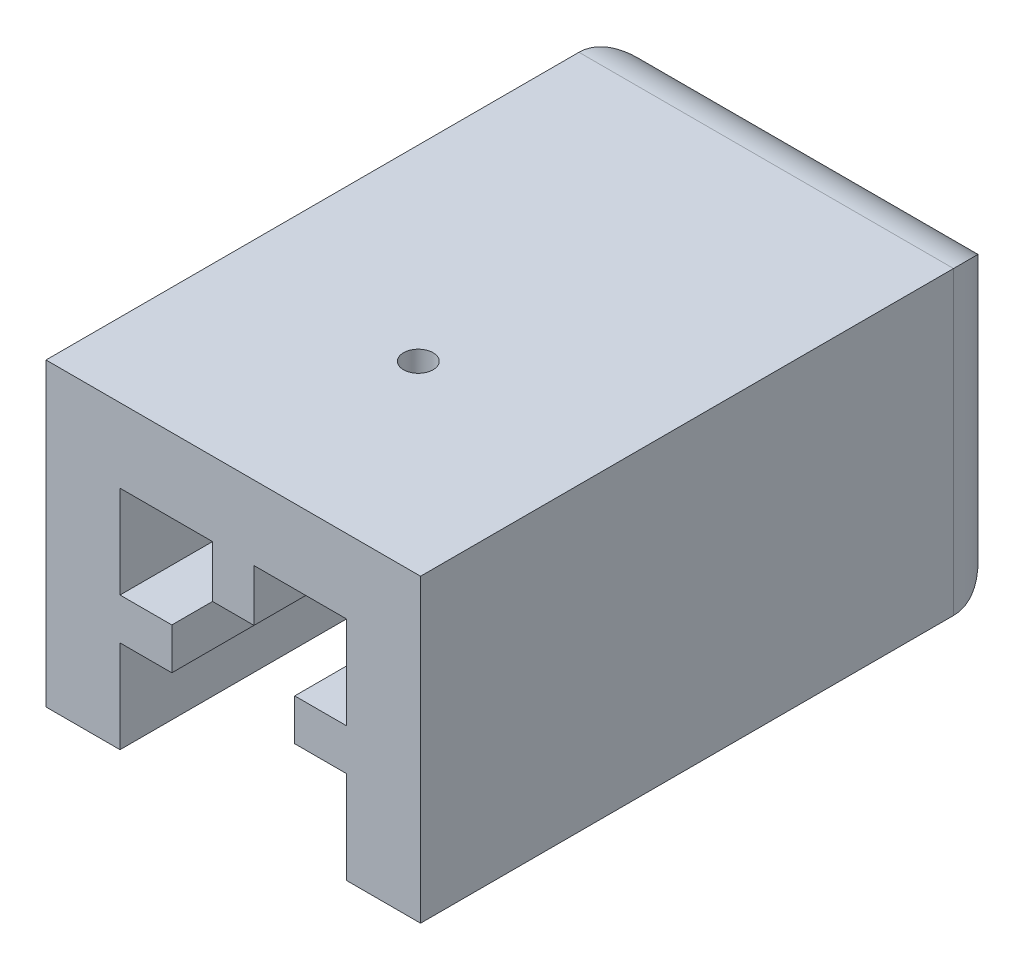
ISO-10303-21;
HEADER;
FILE_DESCRIPTION(('STEP AP214'),'2;1');
FILE_NAME('part.step','',(''),(''),'','','');
FILE_SCHEMA(('AUTOMOTIVE_DESIGN { 1 0 10303 214 1 1 1 1 }'));
ENDSEC;
DATA;
#1=APPLICATION_CONTEXT('core data for automotive mechanical design processes');
#2=APPLICATION_PROTOCOL_DEFINITION('international standard','automotive_design',2000,#1);
#3=PRODUCT_CONTEXT('',#1,'mechanical');
#4=PRODUCT('Part','Part','',(#3));
#5=PRODUCT_RELATED_PRODUCT_CATEGORY('part','',(#4));
#6=PRODUCT_DEFINITION_FORMATION('','',#4);
#7=PRODUCT_DEFINITION_CONTEXT('part definition',#1,'design');
#8=PRODUCT_DEFINITION('design','',#6,#7);
#9=PRODUCT_DEFINITION_SHAPE('','',#8);
#10=(LENGTH_UNIT() NAMED_UNIT(*) SI_UNIT(.MILLI.,.METRE.));
#11=(NAMED_UNIT(*) PLANE_ANGLE_UNIT() SI_UNIT($,.RADIAN.));
#12=(NAMED_UNIT(*) SI_UNIT($,.STERADIAN.) SOLID_ANGLE_UNIT());
#13=UNCERTAINTY_MEASURE_WITH_UNIT(LENGTH_MEASURE(1.E-05),#10,'distance_accuracy_value','');
#14=(GEOMETRIC_REPRESENTATION_CONTEXT(3) GLOBAL_UNCERTAINTY_ASSIGNED_CONTEXT((#13)) GLOBAL_UNIT_ASSIGNED_CONTEXT((#10,
#11,#12)) REPRESENTATION_CONTEXT('',''));
#15=CARTESIAN_POINT('',(0.,0.,0.));
#16=DIRECTION('',(0.,0.,1.));
#17=DIRECTION('',(1.,0.,0.));
#18=AXIS2_PLACEMENT_3D('',#15,#16,#17);
#19=CARTESIAN_POINT('',(-7.65,15.3,20.));
#20=DIRECTION('',(-1.,0.,0.));
#21=DIRECTION('',(0.,-1.,0.));
#22=AXIS2_PLACEMENT_3D('',#19,#20,#21);
#23=PLANE('',#22);
#24=DIRECTION('',(0.,1.,0.));
#25=VECTOR('',#24,1.);
#26=CARTESIAN_POINT('',(-7.65,9.05,3.));
#27=LINE('',#26,#25);
#28=CARTESIAN_POINT('',(-7.65,6.25,3.));
#29=VERTEX_POINT('',#28);
#30=CARTESIAN_POINT('',(-7.65,9.05,3.));
#31=VERTEX_POINT('',#30);
#32=EDGE_CURVE('E442',#29,#31,#27,.T.);
#33=ORIENTED_EDGE('',*,*,#32,.F.);
#34=DIRECTION('',(0.,0.,1.));
#35=VECTOR('',#34,1.);
#36=CARTESIAN_POINT('',(-7.65,6.25,-4.48218696620299));
#37=LINE('',#36,#35);
#38=CARTESIAN_POINT('',(-7.65,6.25,20.));
#39=VERTEX_POINT('',#38);
#40=EDGE_CURVE('E459',#29,#39,#37,.T.);
#41=ORIENTED_EDGE('',*,*,#40,.T.);
#42=DIRECTION('',(0.,1.,0.));
#43=VECTOR('',#42,1.);
#44=CARTESIAN_POINT('',(-7.65,15.3,20.));
#45=LINE('',#44,#43);
#46=CARTESIAN_POINT('',(-7.65,0.,20.));
#47=VERTEX_POINT('',#46);
#48=EDGE_CURVE('E267',#47,#39,#45,.T.);
#49=ORIENTED_EDGE('',*,*,#48,.F.);
#50=DIRECTION('',(0.,0.,-1.));
#51=VECTOR('',#50,1.);
#52=CARTESIAN_POINT('',(-7.65,0.,20.));
#53=LINE('',#52,#51);
#54=CARTESIAN_POINT('',(-7.65,0.,0.));
#55=VERTEX_POINT('',#54);
#56=EDGE_CURVE('E282',#47,#55,#53,.T.);
#57=ORIENTED_EDGE('',*,*,#56,.T.);
#58=DIRECTION('',(0.,1.,0.));
#59=VECTOR('',#58,1.);
#60=CARTESIAN_POINT('',(-7.65,15.3,0.));
#61=LINE('',#60,#59);
#62=CARTESIAN_POINT('',(-7.65,15.3,0.));
#63=VERTEX_POINT('',#62);
#64=EDGE_CURVE('E283',#55,#63,#61,.T.);
#65=ORIENTED_EDGE('',*,*,#64,.T.);
#66=DIRECTION('',(0.,0.,-1.));
#67=VECTOR('',#66,1.);
#68=CARTESIAN_POINT('',(-7.65,15.3,20.));
#69=LINE('',#68,#67);
#70=CARTESIAN_POINT('',(-7.65,15.3,20.));
#71=VERTEX_POINT('',#70);
#72=EDGE_CURVE('E310',#71,#63,#69,.T.);
#73=ORIENTED_EDGE('',*,*,#72,.F.);
#74=CARTESIAN_POINT('',(-7.65,9.05,20.));
#75=VERTEX_POINT('',#74);
#76=EDGE_CURVE('E261',#75,#71,#45,.T.);
#77=ORIENTED_EDGE('',*,*,#76,.F.);
#78=DIRECTION('',(0.,0.,1.));
#79=VECTOR('',#78,1.);
#80=CARTESIAN_POINT('',(-7.65,9.05,-4.48218696620299));
#81=LINE('',#80,#79);
#82=EDGE_CURVE('E462',#31,#75,#81,.T.);
#83=ORIENTED_EDGE('',*,*,#82,.F.);
#84=EDGE_LOOP('',(#33,#41,#49,#57,#65,#73,#77,#83));
#85=FACE_BOUND('',#84,.T.);
#86=ADVANCED_FACE('F51',(#85),#23,.F.);
#87=CARTESIAN_POINT('',(7.65,15.3,20.));
#88=DIRECTION('',(0.,1.,0.));
#89=DIRECTION('',(0.,0.,1.));
#90=AXIS2_PLACEMENT_3D('',#87,#88,#89);
#91=PLANE('',#90);
#92=DIRECTION('',(1.,0.,0.));
#93=VECTOR('',#92,1.);
#94=CARTESIAN_POINT('',(7.65,15.3,20.));
#95=LINE('',#94,#93);
#96=CARTESIAN_POINT('',(1.4,15.3,20.));
#97=VERTEX_POINT('',#96);
#98=CARTESIAN_POINT('',(7.65,15.3,20.));
#99=VERTEX_POINT('',#98);
#100=EDGE_CURVE('E263',#97,#99,#95,.T.);
#101=ORIENTED_EDGE('',*,*,#100,.F.);
#102=DIRECTION('',(0.,0.,1.));
#103=VECTOR('',#102,1.);
#104=CARTESIAN_POINT('',(1.4,15.3,-4.48218696620299));
#105=LINE('',#104,#103);
#106=CARTESIAN_POINT('',(1.4,15.3,3.));
#107=VERTEX_POINT('',#106);
#108=EDGE_CURVE('E429',#107,#97,#105,.T.);
#109=ORIENTED_EDGE('',*,*,#108,.F.);
#110=DIRECTION('',(1.,0.,0.));
#111=VECTOR('',#110,1.);
#112=CARTESIAN_POINT('',(-1.4,15.3,3.));
#113=LINE('',#112,#111);
#114=CARTESIAN_POINT('',(-1.4,15.3,3.));
#115=VERTEX_POINT('',#114);
#116=EDGE_CURVE('E255',#115,#107,#113,.T.);
#117=ORIENTED_EDGE('',*,*,#116,.F.);
#118=DIRECTION('',(0.,0.,1.));
#119=VECTOR('',#118,1.);
#120=CARTESIAN_POINT('',(-1.4,15.3,-4.48218696620299));
#121=LINE('',#120,#119);
#122=CARTESIAN_POINT('',(-1.4,15.3,20.));
#123=VERTEX_POINT('',#122);
#124=EDGE_CURVE('E236',#115,#123,#121,.T.);
#125=ORIENTED_EDGE('',*,*,#124,.T.);
#126=EDGE_CURVE('E252',#71,#123,#95,.T.);
#127=ORIENTED_EDGE('',*,*,#126,.F.);
#128=ORIENTED_EDGE('',*,*,#72,.T.);
#129=DIRECTION('',(1.,0.,0.));
#130=VECTOR('',#129,1.);
#131=CARTESIAN_POINT('',(7.65,15.3,0.));
#132=LINE('',#131,#130);
#133=CARTESIAN_POINT('',(7.65,15.3,0.));
#134=VERTEX_POINT('',#133);
#135=EDGE_CURVE('E286',#63,#134,#132,.T.);
#136=ORIENTED_EDGE('',*,*,#135,.T.);
#137=DIRECTION('',(0.,0.,-1.));
#138=VECTOR('',#137,1.);
#139=CARTESIAN_POINT('',(7.65,15.3,20.));
#140=LINE('',#139,#138);
#141=EDGE_CURVE('E307',#99,#134,#140,.T.);
#142=ORIENTED_EDGE('',*,*,#141,.F.);
#143=EDGE_LOOP('',(#101,#109,#117,#125,#127,#128,#136,#142));
#144=FACE_BOUND('',#143,.T.);
#145=ADVANCED_FACE('F250',(#144),#91,.F.);
#146=CARTESIAN_POINT('',(7.65,15.3,20.));
#147=DIRECTION('',(1.,0.,0.));
#148=DIRECTION('',(0.,1.,0.));
#149=AXIS2_PLACEMENT_3D('',#146,#147,#148);
#150=PLANE('',#149);
#151=DIRECTION('',(0.,-1.,0.));
#152=VECTOR('',#151,1.);
#153=CARTESIAN_POINT('',(7.65,15.3,20.));
#154=LINE('',#153,#152);
#155=CARTESIAN_POINT('',(7.65,6.25,20.));
#156=VERTEX_POINT('',#155);
#157=CARTESIAN_POINT('',(7.65,0.,20.));
#158=VERTEX_POINT('',#157);
#159=EDGE_CURVE('E262',#156,#158,#154,.T.);
#160=ORIENTED_EDGE('',*,*,#159,.F.);
#161=DIRECTION('',(0.,0.,1.));
#162=VECTOR('',#161,1.);
#163=CARTESIAN_POINT('',(7.65,6.25,-4.48218696620299));
#164=LINE('',#163,#162);
#165=CARTESIAN_POINT('',(7.65,6.25,3.));
#166=VERTEX_POINT('',#165);
#167=EDGE_CURVE('E471',#166,#156,#164,.T.);
#168=ORIENTED_EDGE('',*,*,#167,.F.);
#169=DIRECTION('',(0.,-1.,0.));
#170=VECTOR('',#169,1.);
#171=CARTESIAN_POINT('',(7.65,9.05,3.));
#172=LINE('',#171,#170);
#173=CARTESIAN_POINT('',(7.65,9.05,3.));
#174=VERTEX_POINT('',#173);
#175=EDGE_CURVE('E473',#174,#166,#172,.T.);
#176=ORIENTED_EDGE('',*,*,#175,.F.);
#177=DIRECTION('',(0.,0.,1.));
#178=VECTOR('',#177,1.);
#179=CARTESIAN_POINT('',(7.65,9.05,-4.48218696620299));
#180=LINE('',#179,#178);
#181=CARTESIAN_POINT('',(7.65,9.05,20.));
#182=VERTEX_POINT('',#181);
#183=EDGE_CURVE('E483',#174,#182,#180,.T.);
#184=ORIENTED_EDGE('',*,*,#183,.T.);
#185=EDGE_CURVE('E265',#99,#182,#154,.T.);
#186=ORIENTED_EDGE('',*,*,#185,.F.);
#187=ORIENTED_EDGE('',*,*,#141,.T.);
#188=DIRECTION('',(0.,-1.,0.));
#189=VECTOR('',#188,1.);
#190=CARTESIAN_POINT('',(7.65,15.3,0.));
#191=LINE('',#190,#189);
#192=CARTESIAN_POINT('',(7.65,0.,0.));
#193=VERTEX_POINT('',#192);
#194=EDGE_CURVE('E290',#134,#193,#191,.T.);
#195=ORIENTED_EDGE('',*,*,#194,.T.);
#196=DIRECTION('',(0.,0.,-1.));
#197=VECTOR('',#196,1.);
#198=CARTESIAN_POINT('',(7.65,0.,20.));
#199=LINE('',#198,#197);
#200=EDGE_CURVE('E304',#158,#193,#199,.T.);
#201=ORIENTED_EDGE('',*,*,#200,.F.);
#202=EDGE_LOOP('',(#160,#168,#176,#184,#186,#187,#195,#201));
#203=FACE_BOUND('',#202,.T.);
#204=ADVANCED_FACE('F364',(#203),#150,.F.);
#205=CARTESIAN_POINT('',(12.65,0.,20.));
#206=DIRECTION('',(-1.,0.,0.));
#207=DIRECTION('',(0.,0.,1.));
#208=AXIS2_PLACEMENT_3D('',#205,#206,#207);
#209=PLANE('',#208);
#210=DIRECTION('',(0.,0.,-1.));
#211=VECTOR('',#210,1.);
#212=CARTESIAN_POINT('',(12.65,0.,20.));
#213=LINE('',#212,#211);
#214=CARTESIAN_POINT('',(12.65,0.,20.));
#215=VERTEX_POINT('',#214);
#216=CARTESIAN_POINT('',(12.65,0.,-16.));
#217=VERTEX_POINT('',#216);
#218=EDGE_CURVE('E302',#215,#217,#213,.T.);
#219=ORIENTED_EDGE('',*,*,#218,.T.);
#220=DIRECTION('',(0.,-1.,0.));
#221=VECTOR('',#220,1.);
#222=CARTESIAN_POINT('',(12.65,0.,-16.));
#223=LINE('',#222,#221);
#224=CARTESIAN_POINT('',(12.65,20.3,-16.));
#225=VERTEX_POINT('',#224);
#226=EDGE_CURVE('E14',#217,#225,#223,.F.);
#227=ORIENTED_EDGE('',*,*,#226,.T.);
#228=DIRECTION('',(0.,0.,-1.));
#229=VECTOR('',#228,1.);
#230=CARTESIAN_POINT('',(12.65,20.3,20.));
#231=LINE('',#230,#229);
#232=CARTESIAN_POINT('',(12.65,20.3,20.));
#233=VERTEX_POINT('',#232);
#234=EDGE_CURVE('E300',#233,#225,#231,.T.);
#235=ORIENTED_EDGE('',*,*,#234,.F.);
#236=DIRECTION('',(0.,1.,0.));
#237=VECTOR('',#236,1.);
#238=CARTESIAN_POINT('',(12.65,0.,20.));
#239=LINE('',#238,#237);
#240=EDGE_CURVE('E274',#215,#233,#239,.T.);
#241=ORIENTED_EDGE('',*,*,#240,.F.);
#242=EDGE_LOOP('',(#219,#227,#235,#241));
#243=FACE_BOUND('',#242,.T.);
#244=ADVANCED_FACE('F370',(#243),#209,.F.);
#245=CARTESIAN_POINT('',(-12.65,20.3,20.));
#246=DIRECTION('',(0.,-1.,0.));
#247=DIRECTION('',(0.,0.,-1.));
#248=AXIS2_PLACEMENT_3D('',#245,#246,#247);
#249=PLANE('',#248);
#250=CARTESIAN_POINT('',(0.,20.3,7.5));
#251=DIRECTION('',(0.,-1.,0.));
#252=DIRECTION('',(0.,0.,-1.));
#253=AXIS2_PLACEMENT_3D('',#250,#251,#252);
#254=CIRCLE('',#253,1.);
#255=CARTESIAN_POINT('',(0.,20.3,6.5));
#256=VERTEX_POINT('',#255);
#257=EDGE_CURVE('E315',#256,#256,#254,.T.);
#258=ORIENTED_EDGE('',*,*,#257,.T.);
#259=EDGE_LOOP('',(#258));
#260=FACE_BOUND('',#259,.T.);
#261=ORIENTED_EDGE('',*,*,#234,.T.);
#262=DIRECTION('',(-1.,0.,0.));
#263=VECTOR('',#262,1.);
#264=CARTESIAN_POINT('',(-12.65,20.3,-16.));
#265=LINE('',#264,#263);
#266=CARTESIAN_POINT('',(-12.65,20.3,-16.));
#267=VERTEX_POINT('',#266);
#268=EDGE_CURVE('E329',#225,#267,#265,.T.);
#269=ORIENTED_EDGE('',*,*,#268,.T.);
#270=DIRECTION('',(0.,0.,-1.));
#271=VECTOR('',#270,1.);
#272=CARTESIAN_POINT('',(-12.65,20.3,20.));
#273=LINE('',#272,#271);
#274=CARTESIAN_POINT('',(-12.65,20.3,20.));
#275=VERTEX_POINT('',#274);
#276=EDGE_CURVE('E297',#275,#267,#273,.T.);
#277=ORIENTED_EDGE('',*,*,#276,.F.);
#278=DIRECTION('',(-1.,0.,0.));
#279=VECTOR('',#278,1.);
#280=CARTESIAN_POINT('',(-12.65,20.3,20.));
#281=LINE('',#280,#279);
#282=EDGE_CURVE('E276',#233,#275,#281,.T.);
#283=ORIENTED_EDGE('',*,*,#282,.F.);
#284=EDGE_LOOP('',(#261,#269,#277,#283));
#285=FACE_BOUND('',#284,.T.);
#286=ADVANCED_FACE('F374',(#260,#285),#249,.F.);
#287=CARTESIAN_POINT('',(-12.65,0.,20.));
#288=DIRECTION('',(1.,0.,0.));
#289=DIRECTION('',(0.,0.,-1.));
#290=AXIS2_PLACEMENT_3D('',#287,#288,#289);
#291=PLANE('',#290);
#292=ORIENTED_EDGE('',*,*,#276,.T.);
#293=DIRECTION('',(0.,-1.,0.));
#294=VECTOR('',#293,1.);
#295=CARTESIAN_POINT('',(-12.65,0.,-16.));
#296=LINE('',#295,#294);
#297=CARTESIAN_POINT('',(-12.65,0.,-16.));
#298=VERTEX_POINT('',#297);
#299=EDGE_CURVE('E312',#267,#298,#296,.T.);
#300=ORIENTED_EDGE('',*,*,#299,.T.);
#301=DIRECTION('',(0.,0.,-1.));
#302=VECTOR('',#301,1.);
#303=CARTESIAN_POINT('',(-12.65,0.,20.));
#304=LINE('',#303,#302);
#305=CARTESIAN_POINT('',(-12.65,0.,20.));
#306=VERTEX_POINT('',#305);
#307=EDGE_CURVE('E295',#306,#298,#304,.T.);
#308=ORIENTED_EDGE('',*,*,#307,.F.);
#309=DIRECTION('',(0.,-1.,0.));
#310=VECTOR('',#309,1.);
#311=CARTESIAN_POINT('',(-12.65,0.,20.));
#312=LINE('',#311,#310);
#313=EDGE_CURVE('E278',#275,#306,#312,.T.);
#314=ORIENTED_EDGE('',*,*,#313,.F.);
#315=EDGE_LOOP('',(#292,#300,#308,#314));
#316=FACE_BOUND('',#315,.T.);
#317=ADVANCED_FACE('F377',(#316),#291,.F.);
#318=CARTESIAN_POINT('',(-7.65,0.,20.));
#319=DIRECTION('',(0.,1.,0.));
#320=DIRECTION('',(-1.,0.,0.));
#321=AXIS2_PLACEMENT_3D('',#318,#319,#320);
#322=PLANE('',#321);
#323=ORIENTED_EDGE('',*,*,#307,.T.);
#324=DIRECTION('',(-1.,0.,0.));
#325=VECTOR('',#324,1.);
#326=CARTESIAN_POINT('',(-7.65,0.,-16.));
#327=LINE('',#326,#325);
#328=EDGE_CURVE('E60',#298,#217,#327,.F.);
#329=ORIENTED_EDGE('',*,*,#328,.T.);
#330=ORIENTED_EDGE('',*,*,#218,.F.);
#331=DIRECTION('',(1.,0.,0.));
#332=VECTOR('',#331,1.);
#333=CARTESIAN_POINT('',(7.65,0.,20.));
#334=LINE('',#333,#332);
#335=EDGE_CURVE('E272',#158,#215,#334,.T.);
#336=ORIENTED_EDGE('',*,*,#335,.F.);
#337=ORIENTED_EDGE('',*,*,#200,.T.);
#338=DIRECTION('',(-1.,0.,0.));
#339=VECTOR('',#338,1.);
#340=CARTESIAN_POINT('',(12.65,0.,0.));
#341=LINE('',#340,#339);
#342=CARTESIAN_POINT('',(3.85,0.,0.));
#343=VERTEX_POINT('',#342);
#344=EDGE_CURVE('E287',#193,#343,#341,.T.);
#345=ORIENTED_EDGE('',*,*,#344,.T.);
#346=DIRECTION('',(0.,0.,1.));
#347=VECTOR('',#346,1.);
#348=CARTESIAN_POINT('',(3.85,0.,-10.));
#349=LINE('',#348,#347);
#350=CARTESIAN_POINT('',(3.85,0.,-10.));
#351=VERTEX_POINT('',#350);
#352=EDGE_CURVE('E512',#351,#343,#349,.T.);
#353=ORIENTED_EDGE('',*,*,#352,.F.);
#354=DIRECTION('',(-1.,0.,0.));
#355=VECTOR('',#354,1.);
#356=CARTESIAN_POINT('',(0.,0.,-10.));
#357=LINE('',#356,#355);
#358=CARTESIAN_POINT('',(-3.85,0.,-10.));
#359=VERTEX_POINT('',#358);
#360=EDGE_CURVE('E503',#351,#359,#357,.T.);
#361=ORIENTED_EDGE('',*,*,#360,.T.);
#362=DIRECTION('',(0.,0.,1.));
#363=VECTOR('',#362,1.);
#364=CARTESIAN_POINT('',(-3.85,0.,-10.));
#365=LINE('',#364,#363);
#366=CARTESIAN_POINT('',(-3.85,0.,0.));
#367=VERTEX_POINT('',#366);
#368=EDGE_CURVE('E506',#359,#367,#365,.T.);
#369=ORIENTED_EDGE('',*,*,#368,.T.);
#370=EDGE_CURVE('E406',#367,#55,#341,.T.);
#371=ORIENTED_EDGE('',*,*,#370,.T.);
#372=ORIENTED_EDGE('',*,*,#56,.F.);
#373=DIRECTION('',(1.,0.,0.));
#374=VECTOR('',#373,1.);
#375=CARTESIAN_POINT('',(-7.65,0.,20.));
#376=LINE('',#375,#374);
#377=EDGE_CURVE('E280',#306,#47,#376,.T.);
#378=ORIENTED_EDGE('',*,*,#377,.F.);
#379=EDGE_LOOP('',(#323,#329,#330,#336,#337,#345,#353,#361,#369,#371,#372,#378));
#380=FACE_BOUND('',#379,.T.);
#381=ADVANCED_FACE('F381',(#380),#322,.F.);
#382=CARTESIAN_POINT('',(0.,0.,20.));
#383=DIRECTION('',(0.,0.,-1.));
#384=DIRECTION('',(-1.,0.,0.));
#385=AXIS2_PLACEMENT_3D('',#382,#383,#384);
#386=PLANE('',#385);
#387=ORIENTED_EDGE('',*,*,#48,.T.);
#388=DIRECTION('',(1.,0.,0.));
#389=VECTOR('',#388,1.);
#390=CARTESIAN_POINT('',(-4.15,6.25,20.));
#391=LINE('',#390,#389);
#392=CARTESIAN_POINT('',(-4.15,6.25,20.));
#393=VERTEX_POINT('',#392);
#394=EDGE_CURVE('E454',#39,#393,#391,.T.);
#395=ORIENTED_EDGE('',*,*,#394,.T.);
#396=DIRECTION('',(0.,1.,0.));
#397=VECTOR('',#396,1.);
#398=CARTESIAN_POINT('',(-4.15,9.05,20.));
#399=LINE('',#398,#397);
#400=CARTESIAN_POINT('',(-4.15,9.05,20.));
#401=VERTEX_POINT('',#400);
#402=EDGE_CURVE('E441',#393,#401,#399,.T.);
#403=ORIENTED_EDGE('',*,*,#402,.T.);
#404=DIRECTION('',(-1.,0.,0.));
#405=VECTOR('',#404,1.);
#406=CARTESIAN_POINT('',(-7.65,9.05,20.));
#407=LINE('',#406,#405);
#408=EDGE_CURVE('E452',#401,#75,#407,.T.);
#409=ORIENTED_EDGE('',*,*,#408,.T.);
#410=ORIENTED_EDGE('',*,*,#76,.T.);
#411=ORIENTED_EDGE('',*,*,#126,.T.);
#412=DIRECTION('',(0.,-1.,0.));
#413=VECTOR('',#412,1.);
#414=CARTESIAN_POINT('',(-1.4,15.3,20.));
#415=LINE('',#414,#413);
#416=CARTESIAN_POINT('',(-1.4,11.8,20.));
#417=VERTEX_POINT('',#416);
#418=EDGE_CURVE('E232',#123,#417,#415,.T.);
#419=ORIENTED_EDGE('',*,*,#418,.T.);
#420=DIRECTION('',(1.,0.,0.));
#421=VECTOR('',#420,1.);
#422=CARTESIAN_POINT('',(-1.4,11.8,20.));
#423=LINE('',#422,#421);
#424=CARTESIAN_POINT('',(1.4,11.8,20.));
#425=VERTEX_POINT('',#424);
#426=EDGE_CURVE('E244',#417,#425,#423,.T.);
#427=ORIENTED_EDGE('',*,*,#426,.T.);
#428=DIRECTION('',(0.,1.,0.));
#429=VECTOR('',#428,1.);
#430=CARTESIAN_POINT('',(1.4,11.8,20.));
#431=LINE('',#430,#429);
#432=EDGE_CURVE('E256',#425,#97,#431,.T.);
#433=ORIENTED_EDGE('',*,*,#432,.T.);
#434=ORIENTED_EDGE('',*,*,#100,.T.);
#435=ORIENTED_EDGE('',*,*,#185,.T.);
#436=DIRECTION('',(-1.,0.,0.));
#437=VECTOR('',#436,1.);
#438=CARTESIAN_POINT('',(7.65,9.05,20.));
#439=LINE('',#438,#437);
#440=CARTESIAN_POINT('',(4.15,9.05,20.));
#441=VERTEX_POINT('',#440);
#442=EDGE_CURVE('E467',#182,#441,#439,.T.);
#443=ORIENTED_EDGE('',*,*,#442,.T.);
#444=DIRECTION('',(0.,-1.,0.));
#445=VECTOR('',#444,1.);
#446=CARTESIAN_POINT('',(4.15,9.05,20.));
#447=LINE('',#446,#445);
#448=CARTESIAN_POINT('',(4.15,6.25,20.));
#449=VERTEX_POINT('',#448);
#450=EDGE_CURVE('E478',#441,#449,#447,.T.);
#451=ORIENTED_EDGE('',*,*,#450,.T.);
#452=DIRECTION('',(1.,0.,0.));
#453=VECTOR('',#452,1.);
#454=CARTESIAN_POINT('',(4.15,6.25,20.));
#455=LINE('',#454,#453);
#456=EDGE_CURVE('E481',#449,#156,#455,.T.);
#457=ORIENTED_EDGE('',*,*,#456,.T.);
#458=ORIENTED_EDGE('',*,*,#159,.T.);
#459=ORIENTED_EDGE('',*,*,#335,.T.);
#460=ORIENTED_EDGE('',*,*,#240,.T.);
#461=ORIENTED_EDGE('',*,*,#282,.T.);
#462=ORIENTED_EDGE('',*,*,#313,.T.);
#463=ORIENTED_EDGE('',*,*,#377,.T.);
#464=EDGE_LOOP('',(#387,#395,#403,#409,#410,#411,#419,#427,#433,#434,#435,#443,#451,#457,#458,
#459,#460,#461,#462,#463));
#465=FACE_BOUND('',#464,.T.);
#466=ADVANCED_FACE('F259',(#465),#386,.F.);
#467=CARTESIAN_POINT('',(0.,0.,0.));
#468=DIRECTION('',(0.,0.,1.));
#469=DIRECTION('',(1.,0.,0.));
#470=AXIS2_PLACEMENT_3D('',#467,#468,#469);
#471=PLANE('',#470);
#472=DIRECTION('',(0.,-1.,0.));
#473=VECTOR('',#472,1.);
#474=CARTESIAN_POINT('',(-3.85,0.,0.));
#475=LINE('',#474,#473);
#476=CARTESIAN_POINT('',(-3.85,7.65,0.));
#477=VERTEX_POINT('',#476);
#478=EDGE_CURVE('E493',#477,#367,#475,.T.);
#479=ORIENTED_EDGE('',*,*,#478,.F.);
#480=CARTESIAN_POINT('',(0.,7.65,0.));
#481=DIRECTION('',(0.,0.,-1.));
#482=DIRECTION('',(-1.,0.,0.));
#483=AXIS2_PLACEMENT_3D('',#480,#481,#482);
#484=CIRCLE('',#483,3.85);
#485=CARTESIAN_POINT('',(3.85,7.65,0.));
#486=VERTEX_POINT('',#485);
#487=EDGE_CURVE('E407',#477,#486,#484,.T.);
#488=ORIENTED_EDGE('',*,*,#487,.T.);
#489=DIRECTION('',(0.,-1.,0.));
#490=VECTOR('',#489,1.);
#491=CARTESIAN_POINT('',(3.85,0.,0.));
#492=LINE('',#491,#490);
#493=EDGE_CURVE('E498',#486,#343,#492,.T.);
#494=ORIENTED_EDGE('',*,*,#493,.T.);
#495=ORIENTED_EDGE('',*,*,#344,.F.);
#496=ORIENTED_EDGE('',*,*,#194,.F.);
#497=ORIENTED_EDGE('',*,*,#135,.F.);
#498=ORIENTED_EDGE('',*,*,#64,.F.);
#499=ORIENTED_EDGE('',*,*,#370,.F.);
#500=EDGE_LOOP('',(#479,#488,#494,#495,#496,#497,#498,#499));
#501=FACE_BOUND('',#500,.T.);
#502=ADVANCED_FACE('F387',(#501),#471,.T.);
#503=CARTESIAN_POINT('',(0.,0.,-20.));
#504=DIRECTION('',(0.,0.,1.));
#505=DIRECTION('',(1.,0.,0.));
#506=AXIS2_PLACEMENT_3D('',#503,#504,#505);
#507=PLANE('',#506);
#508=CARTESIAN_POINT('',(0.,7.65,-20.));
#509=DIRECTION('',(0.,0.,-1.));
#510=DIRECTION('',(-1.,0.,0.));
#511=AXIS2_PLACEMENT_3D('',#508,#509,#510);
#512=CIRCLE('',#511,3.85);
#513=CARTESIAN_POINT('',(-1.22474487139158,4.,-20.));
#514=VERTEX_POINT('',#513);
#515=CARTESIAN_POINT('',(1.22474487139159,4.,-20.));
#516=VERTEX_POINT('',#515);
#517=EDGE_CURVE('E400',#514,#516,#512,.T.);
#518=ORIENTED_EDGE('',*,*,#517,.F.);
#519=DIRECTION('',(-1.,0.,0.));
#520=VECTOR('',#519,1.);
#521=CARTESIAN_POINT('',(0.,4.,-20.));
#522=LINE('',#521,#520);
#523=CARTESIAN_POINT('',(-8.65,4.,-20.));
#524=VERTEX_POINT('',#523);
#525=EDGE_CURVE('E327',#514,#524,#522,.T.);
#526=ORIENTED_EDGE('',*,*,#525,.T.);
#527=DIRECTION('',(0.,-1.,0.));
#528=VECTOR('',#527,1.);
#529=CARTESIAN_POINT('',(-8.65,0.,-20.));
#530=LINE('',#529,#528);
#531=CARTESIAN_POINT('',(-8.65,16.3,-20.));
#532=VERTEX_POINT('',#531);
#533=EDGE_CURVE('E324',#524,#532,#530,.F.);
#534=ORIENTED_EDGE('',*,*,#533,.T.);
#535=DIRECTION('',(-1.,0.,0.));
#536=VECTOR('',#535,1.);
#537=CARTESIAN_POINT('',(0.,16.3,-20.));
#538=LINE('',#537,#536);
#539=CARTESIAN_POINT('',(8.65,16.3,-20.));
#540=VERTEX_POINT('',#539);
#541=EDGE_CURVE('E322',#532,#540,#538,.F.);
#542=ORIENTED_EDGE('',*,*,#541,.T.);
#543=DIRECTION('',(0.,-1.,0.));
#544=VECTOR('',#543,1.);
#545=CARTESIAN_POINT('',(8.65,0.,-20.));
#546=LINE('',#545,#544);
#547=CARTESIAN_POINT('',(8.65,4.,-20.));
#548=VERTEX_POINT('',#547);
#549=EDGE_CURVE('E318',#540,#548,#546,.T.);
#550=ORIENTED_EDGE('',*,*,#549,.T.);
#551=DIRECTION('',(-1.,0.,0.));
#552=VECTOR('',#551,1.);
#553=CARTESIAN_POINT('',(0.,4.,-20.));
#554=LINE('',#553,#552);
#555=EDGE_CURVE('E320',#548,#516,#554,.T.);
#556=ORIENTED_EDGE('',*,*,#555,.T.);
#557=EDGE_LOOP('',(#518,#526,#534,#542,#550,#556));
#558=FACE_BOUND('',#557,.T.);
#559=ADVANCED_FACE('F389',(#558),#507,.F.);
#560=CARTESIAN_POINT('',(0.,7.65,-20.));
#561=DIRECTION('',(0.,0.,1.));
#562=DIRECTION('',(1.,0.,0.));
#563=AXIS2_PLACEMENT_3D('',#560,#561,#562);
#564=CYLINDRICAL_SURFACE('',#563,3.85);
#565=DIRECTION('',(0.,0.,1.));
#566=VECTOR('',#565,1.);
#567=CARTESIAN_POINT('',(-3.85,7.65,-10.));
#568=LINE('',#567,#566);
#569=CARTESIAN_POINT('',(-3.85,7.65,-10.));
#570=VERTEX_POINT('',#569);
#571=EDGE_CURVE('E517',#570,#477,#568,.T.);
#572=ORIENTED_EDGE('',*,*,#571,.F.);
#573=CARTESIAN_POINT('',(0.,7.65,-10.));
#574=DIRECTION('',(0.,0.,-1.));
#575=DIRECTION('',(-1.,0.,0.));
#576=AXIS2_PLACEMENT_3D('',#573,#574,#575);
#577=CIRCLE('',#576,3.85);
#578=CARTESIAN_POINT('',(3.85,7.65,-10.));
#579=VERTEX_POINT('',#578);
#580=EDGE_CURVE('E497',#579,#570,#577,.T.);
#581=ORIENTED_EDGE('',*,*,#580,.F.);
#582=DIRECTION('',(0.,0.,1.));
#583=VECTOR('',#582,1.);
#584=CARTESIAN_POINT('',(3.85,7.65,-10.));
#585=LINE('',#584,#583);
#586=EDGE_CURVE('E514',#579,#486,#585,.T.);
#587=ORIENTED_EDGE('',*,*,#586,.T.);
#588=ORIENTED_EDGE('',*,*,#487,.F.);
#589=EDGE_LOOP('',(#572,#581,#587,#588));
#590=FACE_BOUND('',#589,.T.);
#591=ORIENTED_EDGE('',*,*,#517,.T.);
#592=CARTESIAN_POINT('',(1.22474487139159,4.,-20.));
#593=CARTESIAN_POINT('',(1.12076541043562,3.96509696484032,-19.9999689679581));
#594=CARTESIAN_POINT('',(1.01528922896825,3.93466109716184,-19.9995417166679));
#595=CARTESIAN_POINT('',(0.802127655132638,3.88289305474564,-19.9983776089531));
#596=CARTESIAN_POINT('',(0.694442273285607,3.86156083666274,-19.9976407540026));
#597=CARTESIAN_POINT('',(0.480520577017971,3.82861194062119,-19.9963575093212));
#598=CARTESIAN_POINT('',(0.374321582492816,3.81675258370364,-19.9958065862318));
#599=CARTESIAN_POINT('',(0.161312985846782,3.80190016402533,-19.995099136893));
#600=CARTESIAN_POINT('',(0.0545034533721241,3.79890610942217,-19.9949425665241));
#601=CARTESIAN_POINT('',(-0.150514775023439,3.80168785357764,-19.9950809171016));
#602=CARTESIAN_POINT('',(-0.248733332955223,3.80678652052991,-19.9953409931191));
#603=CARTESIAN_POINT('',(-0.44449063045657,3.8244821282927,-19.9961568134029));
#604=CARTESIAN_POINT('',(-0.542029384183446,3.83707891247572,-19.9967125514932));
#605=CARTESIAN_POINT('',(-0.738288253302186,3.87010918499674,-19.9979270247451));
#606=CARTESIAN_POINT('',(-0.836976647498955,3.89073128906903,-19.9985879934548));
#607=CARTESIAN_POINT('',(-1.03244569411086,3.93964622298089,-19.9996135676118));
#608=CARTESIAN_POINT('',(-1.12922615006104,3.96793983839419,-19.9999781426928));
#609=CARTESIAN_POINT('',(-1.22474487139158,4.,-20.));
#610=B_SPLINE_CURVE_WITH_KNOTS('',3,(#592,#593,#594,#595,#596,#597,#598,#599,#600,#601,#602,
#603,#604,#605,#606,#607,#608,#609),.UNSPECIFIED.,.F.,.F.,(4,2,2,2,2,2,2,2,4),(0.,
0.328940572851933,0.65787957950272,0.978094127161952,1.29827284813905,1.59304169064195,
1.88780437596048,2.18995949062972,2.49214555810803),.UNSPECIFIED.);
#611=EDGE_CURVE('E331',#516,#514,#610,.T.);
#612=ORIENTED_EDGE('',*,*,#611,.T.);
#613=EDGE_LOOP('',(#591,#612));
#614=FACE_BOUND('',#613,.T.);
#615=ADVANCED_FACE('F339',(#590,#614),#564,.F.);
#616=CARTESIAN_POINT('',(-3.85,0.,-10.));
#617=DIRECTION('',(-1.,0.,0.));
#618=DIRECTION('',(0.,-1.,0.));
#619=AXIS2_PLACEMENT_3D('',#616,#617,#618);
#620=PLANE('',#619);
#621=ORIENTED_EDGE('',*,*,#478,.T.);
#622=ORIENTED_EDGE('',*,*,#368,.F.);
#623=DIRECTION('',(0.,-1.,0.));
#624=VECTOR('',#623,1.);
#625=CARTESIAN_POINT('',(-3.85,0.,-10.));
#626=LINE('',#625,#624);
#627=EDGE_CURVE('E494',#570,#359,#626,.T.);
#628=ORIENTED_EDGE('',*,*,#627,.F.);
#629=ORIENTED_EDGE('',*,*,#571,.T.);
#630=EDGE_LOOP('',(#621,#622,#628,#629));
#631=FACE_BOUND('',#630,.T.);
#632=ADVANCED_FACE('F396',(#631),#620,.F.);
#633=CARTESIAN_POINT('',(3.85,0.,-10.));
#634=DIRECTION('',(-1.,0.,0.));
#635=DIRECTION('',(0.,-1.,0.));
#636=AXIS2_PLACEMENT_3D('',#633,#634,#635);
#637=PLANE('',#636);
#638=ORIENTED_EDGE('',*,*,#493,.F.);
#639=ORIENTED_EDGE('',*,*,#586,.F.);
#640=DIRECTION('',(0.,-1.,0.));
#641=VECTOR('',#640,1.);
#642=CARTESIAN_POINT('',(3.85,0.,-10.));
#643=LINE('',#642,#641);
#644=EDGE_CURVE('E501',#579,#351,#643,.T.);
#645=ORIENTED_EDGE('',*,*,#644,.T.);
#646=ORIENTED_EDGE('',*,*,#352,.T.);
#647=EDGE_LOOP('',(#638,#639,#645,#646));
#648=FACE_BOUND('',#647,.T.);
#649=ADVANCED_FACE('F589',(#648),#637,.T.);
#650=CARTESIAN_POINT('',(0.,0.,-10.));
#651=DIRECTION('',(0.,0.,-1.));
#652=DIRECTION('',(-1.,0.,0.));
#653=AXIS2_PLACEMENT_3D('',#650,#651,#652);
#654=PLANE('',#653);
#655=ORIENTED_EDGE('',*,*,#627,.T.);
#656=ORIENTED_EDGE('',*,*,#360,.F.);
#657=ORIENTED_EDGE('',*,*,#644,.F.);
#658=ORIENTED_EDGE('',*,*,#580,.T.);
#659=EDGE_LOOP('',(#655,#656,#657,#658));
#660=FACE_BOUND('',#659,.T.);
#661=ADVANCED_FACE('F579',(#660),#654,.F.);
#662=CARTESIAN_POINT('',(4.15,6.25,-4.48218696620299));
#663=DIRECTION('',(0.,-1.,0.));
#664=DIRECTION('',(0.,0.,-1.));
#665=AXIS2_PLACEMENT_3D('',#662,#663,#664);
#666=PLANE('',#665);
#667=DIRECTION('',(-1.,0.,0.));
#668=VECTOR('',#667,1.);
#669=CARTESIAN_POINT('',(4.15,6.25,3.));
#670=LINE('',#669,#668);
#671=CARTESIAN_POINT('',(4.15,6.25,3.));
#672=VERTEX_POINT('',#671);
#673=EDGE_CURVE('E470',#166,#672,#670,.T.);
#674=ORIENTED_EDGE('',*,*,#673,.F.);
#675=ORIENTED_EDGE('',*,*,#167,.T.);
#676=ORIENTED_EDGE('',*,*,#456,.F.);
#677=DIRECTION('',(0.,0.,1.));
#678=VECTOR('',#677,1.);
#679=CARTESIAN_POINT('',(4.15,6.25,-4.48218696620299));
#680=LINE('',#679,#678);
#681=EDGE_CURVE('E486',#672,#449,#680,.T.);
#682=ORIENTED_EDGE('',*,*,#681,.F.);
#683=EDGE_LOOP('',(#674,#675,#676,#682));
#684=FACE_BOUND('',#683,.T.);
#685=ADVANCED_FACE('F575',(#684),#666,.T.);
#686=CARTESIAN_POINT('',(4.15,9.05,-4.48218696620299));
#687=DIRECTION('',(-1.,0.,0.));
#688=DIRECTION('',(0.,0.,1.));
#689=AXIS2_PLACEMENT_3D('',#686,#687,#688);
#690=PLANE('',#689);
#691=DIRECTION('',(0.,1.,0.));
#692=VECTOR('',#691,1.);
#693=CARTESIAN_POINT('',(4.15,9.05,3.));
#694=LINE('',#693,#692);
#695=CARTESIAN_POINT('',(4.15,9.05,3.));
#696=VERTEX_POINT('',#695);
#697=EDGE_CURVE('E468',#672,#696,#694,.T.);
#698=ORIENTED_EDGE('',*,*,#697,.F.);
#699=ORIENTED_EDGE('',*,*,#681,.T.);
#700=ORIENTED_EDGE('',*,*,#450,.F.);
#701=DIRECTION('',(0.,0.,1.));
#702=VECTOR('',#701,1.);
#703=CARTESIAN_POINT('',(4.15,9.05,-4.48218696620299));
#704=LINE('',#703,#702);
#705=EDGE_CURVE('E488',#696,#441,#704,.T.);
#706=ORIENTED_EDGE('',*,*,#705,.F.);
#707=EDGE_LOOP('',(#698,#699,#700,#706));
#708=FACE_BOUND('',#707,.T.);
#709=ADVANCED_FACE('F578',(#708),#690,.T.);
#710=CARTESIAN_POINT('',(7.65,9.05,-4.48218696620299));
#711=DIRECTION('',(0.,1.,0.));
#712=DIRECTION('',(0.,0.,1.));
#713=AXIS2_PLACEMENT_3D('',#710,#711,#712);
#714=PLANE('',#713);
#715=DIRECTION('',(1.,0.,0.));
#716=VECTOR('',#715,1.);
#717=CARTESIAN_POINT('',(7.65,9.05,3.));
#718=LINE('',#717,#716);
#719=EDGE_CURVE('E475',#696,#174,#718,.T.);
#720=ORIENTED_EDGE('',*,*,#719,.F.);
#721=ORIENTED_EDGE('',*,*,#705,.T.);
#722=ORIENTED_EDGE('',*,*,#442,.F.);
#723=ORIENTED_EDGE('',*,*,#183,.F.);
#724=EDGE_LOOP('',(#720,#721,#722,#723));
#725=FACE_BOUND('',#724,.T.);
#726=ADVANCED_FACE('F573',(#725),#714,.T.);
#727=CARTESIAN_POINT('',(0.,0.,3.));
#728=DIRECTION('',(0.,0.,1.));
#729=DIRECTION('',(1.,0.,0.));
#730=AXIS2_PLACEMENT_3D('',#727,#728,#729);
#731=PLANE('',#730);
#732=ORIENTED_EDGE('',*,*,#175,.T.);
#733=ORIENTED_EDGE('',*,*,#673,.T.);
#734=ORIENTED_EDGE('',*,*,#697,.T.);
#735=ORIENTED_EDGE('',*,*,#719,.T.);
#736=EDGE_LOOP('',(#732,#733,#734,#735));
#737=FACE_BOUND('',#736,.T.);
#738=ADVANCED_FACE('F566',(#737),#731,.F.);
#739=CARTESIAN_POINT('',(-4.15,9.05,-4.48218696620299));
#740=DIRECTION('',(1.,0.,0.));
#741=DIRECTION('',(0.,0.,-1.));
#742=AXIS2_PLACEMENT_3D('',#739,#740,#741);
#743=PLANE('',#742);
#744=DIRECTION('',(0.,-1.,0.));
#745=VECTOR('',#744,1.);
#746=CARTESIAN_POINT('',(-4.15,9.05,3.));
#747=LINE('',#746,#745);
#748=CARTESIAN_POINT('',(-4.15,9.05,3.));
#749=VERTEX_POINT('',#748);
#750=CARTESIAN_POINT('',(-4.15,6.25,3.));
#751=VERTEX_POINT('',#750);
#752=EDGE_CURVE('E447',#749,#751,#747,.T.);
#753=ORIENTED_EDGE('',*,*,#752,.F.);
#754=DIRECTION('',(0.,0.,1.));
#755=VECTOR('',#754,1.);
#756=CARTESIAN_POINT('',(-4.15,9.05,-4.48218696620299));
#757=LINE('',#756,#755);
#758=EDGE_CURVE('E457',#749,#401,#757,.T.);
#759=ORIENTED_EDGE('',*,*,#758,.T.);
#760=ORIENTED_EDGE('',*,*,#402,.F.);
#761=DIRECTION('',(0.,0.,1.));
#762=VECTOR('',#761,1.);
#763=CARTESIAN_POINT('',(-4.15,6.25,-4.48218696620299));
#764=LINE('',#763,#762);
#765=EDGE_CURVE('E445',#751,#393,#764,.T.);
#766=ORIENTED_EDGE('',*,*,#765,.F.);
#767=EDGE_LOOP('',(#753,#759,#760,#766));
#768=FACE_BOUND('',#767,.T.);
#769=ADVANCED_FACE('F555',(#768),#743,.T.);
#770=CARTESIAN_POINT('',(-4.15,6.25,-4.48218696620299));
#771=DIRECTION('',(0.,-1.,0.));
#772=DIRECTION('',(0.,0.,-1.));
#773=AXIS2_PLACEMENT_3D('',#770,#771,#772);
#774=PLANE('',#773);
#775=DIRECTION('',(-1.,0.,0.));
#776=VECTOR('',#775,1.);
#777=CARTESIAN_POINT('',(-4.15,6.25,3.));
#778=LINE('',#777,#776);
#779=EDGE_CURVE('E444',#751,#29,#778,.T.);
#780=ORIENTED_EDGE('',*,*,#779,.F.);
#781=ORIENTED_EDGE('',*,*,#765,.T.);
#782=ORIENTED_EDGE('',*,*,#394,.F.);
#783=ORIENTED_EDGE('',*,*,#40,.F.);
#784=EDGE_LOOP('',(#780,#781,#782,#783));
#785=FACE_BOUND('',#784,.T.);
#786=ADVANCED_FACE('F558',(#785),#774,.T.);
#787=CARTESIAN_POINT('',(-7.65,9.05,-4.48218696620299));
#788=DIRECTION('',(0.,1.,0.));
#789=DIRECTION('',(0.,0.,1.));
#790=AXIS2_PLACEMENT_3D('',#787,#788,#789);
#791=PLANE('',#790);
#792=DIRECTION('',(1.,0.,0.));
#793=VECTOR('',#792,1.);
#794=CARTESIAN_POINT('',(-7.65,9.05,3.));
#795=LINE('',#794,#793);
#796=EDGE_CURVE('E449',#31,#749,#795,.T.);
#797=ORIENTED_EDGE('',*,*,#796,.F.);
#798=ORIENTED_EDGE('',*,*,#82,.T.);
#799=ORIENTED_EDGE('',*,*,#408,.F.);
#800=ORIENTED_EDGE('',*,*,#758,.F.);
#801=EDGE_LOOP('',(#797,#798,#799,#800));
#802=FACE_BOUND('',#801,.T.);
#803=ADVANCED_FACE('F547',(#802),#791,.T.);
#804=CARTESIAN_POINT('',(0.,0.,3.));
#805=DIRECTION('',(0.,0.,1.));
#806=DIRECTION('',(1.,0.,0.));
#807=AXIS2_PLACEMENT_3D('',#804,#805,#806);
#808=PLANE('',#807);
#809=ORIENTED_EDGE('',*,*,#752,.T.);
#810=ORIENTED_EDGE('',*,*,#779,.T.);
#811=ORIENTED_EDGE('',*,*,#32,.T.);
#812=ORIENTED_EDGE('',*,*,#796,.T.);
#813=EDGE_LOOP('',(#809,#810,#811,#812));
#814=FACE_BOUND('',#813,.T.);
#815=ADVANCED_FACE('F551',(#814),#808,.F.);
#816=CARTESIAN_POINT('',(1.4,11.8,-4.48218696620299));
#817=DIRECTION('',(1.,0.,0.));
#818=DIRECTION('',(0.,1.,0.));
#819=AXIS2_PLACEMENT_3D('',#816,#817,#818);
#820=PLANE('',#819);
#821=DIRECTION('',(0.,-1.,0.));
#822=VECTOR('',#821,1.);
#823=CARTESIAN_POINT('',(1.4,11.8,3.));
#824=LINE('',#823,#822);
#825=CARTESIAN_POINT('',(1.4,11.8,3.));
#826=VERTEX_POINT('',#825);
#827=EDGE_CURVE('E428',#107,#826,#824,.T.);
#828=ORIENTED_EDGE('',*,*,#827,.F.);
#829=ORIENTED_EDGE('',*,*,#108,.T.);
#830=ORIENTED_EDGE('',*,*,#432,.F.);
#831=DIRECTION('',(0.,0.,1.));
#832=VECTOR('',#831,1.);
#833=CARTESIAN_POINT('',(1.4,11.8,-4.48218696620299));
#834=LINE('',#833,#832);
#835=EDGE_CURVE('E437',#826,#425,#834,.T.);
#836=ORIENTED_EDGE('',*,*,#835,.F.);
#837=EDGE_LOOP('',(#828,#829,#830,#836));
#838=FACE_BOUND('',#837,.T.);
#839=ADVANCED_FACE('F653',(#838),#820,.T.);
#840=CARTESIAN_POINT('',(-1.4,11.8,-4.48218696620299));
#841=DIRECTION('',(0.,-1.,0.));
#842=DIRECTION('',(0.,0.,-1.));
#843=AXIS2_PLACEMENT_3D('',#840,#841,#842);
#844=PLANE('',#843);
#845=CARTESIAN_POINT('',(0.,11.8,7.5));
#846=DIRECTION('',(0.,-1.,0.));
#847=DIRECTION('',(0.,0.,-1.));
#848=AXIS2_PLACEMENT_3D('',#845,#846,#847);
#849=CIRCLE('',#848,1.);
#850=CARTESIAN_POINT('',(0.,11.8,6.5));
#851=VERTEX_POINT('',#850);
#852=EDGE_CURVE('E245',#851,#851,#849,.T.);
#853=ORIENTED_EDGE('',*,*,#852,.F.);
#854=EDGE_LOOP('',(#853));
#855=FACE_BOUND('',#854,.T.);
#856=DIRECTION('',(-1.,0.,0.));
#857=VECTOR('',#856,1.);
#858=CARTESIAN_POINT('',(-1.4,11.8,3.));
#859=LINE('',#858,#857);
#860=CARTESIAN_POINT('',(-1.4,11.8,3.));
#861=VERTEX_POINT('',#860);
#862=EDGE_CURVE('E426',#826,#861,#859,.T.);
#863=ORIENTED_EDGE('',*,*,#862,.F.);
#864=ORIENTED_EDGE('',*,*,#835,.T.);
#865=ORIENTED_EDGE('',*,*,#426,.F.);
#866=DIRECTION('',(0.,0.,1.));
#867=VECTOR('',#866,1.);
#868=CARTESIAN_POINT('',(-1.4,11.8,-4.48218696620299));
#869=LINE('',#868,#867);
#870=EDGE_CURVE('E239',#861,#417,#869,.T.);
#871=ORIENTED_EDGE('',*,*,#870,.F.);
#872=EDGE_LOOP('',(#863,#864,#865,#871));
#873=FACE_BOUND('',#872,.T.);
#874=ADVANCED_FACE('F661',(#855,#873),#844,.T.);
#875=CARTESIAN_POINT('',(-1.4,15.3,-4.48218696620299));
#876=DIRECTION('',(-1.,0.,0.));
#877=DIRECTION('',(0.,-1.,0.));
#878=AXIS2_PLACEMENT_3D('',#875,#876,#877);
#879=PLANE('',#878);
#880=DIRECTION('',(0.,1.,0.));
#881=VECTOR('',#880,1.);
#882=CARTESIAN_POINT('',(-1.4,15.3,3.));
#883=LINE('',#882,#881);
#884=EDGE_CURVE('E431',#861,#115,#883,.T.);
#885=ORIENTED_EDGE('',*,*,#884,.F.);
#886=ORIENTED_EDGE('',*,*,#870,.T.);
#887=ORIENTED_EDGE('',*,*,#418,.F.);
#888=ORIENTED_EDGE('',*,*,#124,.F.);
#889=EDGE_LOOP('',(#885,#886,#887,#888));
#890=FACE_BOUND('',#889,.T.);
#891=ADVANCED_FACE('F235',(#890),#879,.T.);
#892=CARTESIAN_POINT('',(0.,0.,3.));
#893=DIRECTION('',(0.,0.,1.));
#894=DIRECTION('',(1.,0.,0.));
#895=AXIS2_PLACEMENT_3D('',#892,#893,#894);
#896=PLANE('',#895);
#897=ORIENTED_EDGE('',*,*,#116,.T.);
#898=ORIENTED_EDGE('',*,*,#827,.T.);
#899=ORIENTED_EDGE('',*,*,#862,.T.);
#900=ORIENTED_EDGE('',*,*,#884,.T.);
#901=EDGE_LOOP('',(#897,#898,#899,#900));
#902=FACE_BOUND('',#901,.T.);
#903=ADVANCED_FACE('F673',(#902),#896,.F.);
#904=CARTESIAN_POINT('',(0.,20.3,7.5));
#905=DIRECTION('',(0.,-1.,0.));
#906=DIRECTION('',(0.,0.,-1.));
#907=AXIS2_PLACEMENT_3D('',#904,#905,#906);
#908=CYLINDRICAL_SURFACE('',#907,1.);
#909=ORIENTED_EDGE('',*,*,#852,.T.);
#910=EDGE_LOOP('',(#909));
#911=FACE_BOUND('',#910,.T.);
#912=ORIENTED_EDGE('',*,*,#257,.F.);
#913=EDGE_LOOP('',(#912));
#914=FACE_BOUND('',#913,.T.);
#915=ADVANCED_FACE('F356',(#911,#914),#908,.F.);
#916=CARTESIAN_POINT('',(8.65,0.,-16.));
#917=DIRECTION('',(0.,-1.,0.));
#918=DIRECTION('',(0.,0.,-1.));
#919=AXIS2_PLACEMENT_3D('',#916,#917,#918);
#920=CYLINDRICAL_SURFACE('',#919,4.);
#921=CARTESIAN_POINT('',(8.65,4.,-16.));
#922=DIRECTION('',(-0.707106781186547,-0.707106781186548,0.));
#923=DIRECTION('',(0.707106781186548,-0.707106781186547,0.));
#924=AXIS2_PLACEMENT_3D('',#921,#922,#923);
#925=ELLIPSE('',#924,5.65685424949238,4.);
#926=EDGE_CURVE('E416',#548,#217,#925,.T.);
#927=ORIENTED_EDGE('',*,*,#926,.F.);
#928=ORIENTED_EDGE('',*,*,#549,.F.);
#929=CARTESIAN_POINT('',(8.65,16.3,-16.));
#930=DIRECTION('',(0.707106781186547,-0.707106781186547,0.));
#931=DIRECTION('',(-0.707106781186547,-0.707106781186547,0.));
#932=AXIS2_PLACEMENT_3D('',#929,#930,#931);
#933=ELLIPSE('',#932,5.65685424949238,4.);
#934=EDGE_CURVE('E55',#225,#540,#933,.F.);
#935=ORIENTED_EDGE('',*,*,#934,.F.);
#936=ORIENTED_EDGE('',*,*,#226,.F.);
#937=EDGE_LOOP('',(#927,#928,#935,#936));
#938=FACE_BOUND('',#937,.T.);
#939=ADVANCED_FACE('F53',(#938),#920,.T.);
#940=CARTESIAN_POINT('',(-12.65,16.3,-16.));
#941=DIRECTION('',(-1.,0.,0.));
#942=DIRECTION('',(0.,0.,1.));
#943=AXIS2_PLACEMENT_3D('',#940,#941,#942);
#944=CYLINDRICAL_SURFACE('',#943,4.);
#945=ORIENTED_EDGE('',*,*,#934,.T.);
#946=ORIENTED_EDGE('',*,*,#541,.F.);
#947=CARTESIAN_POINT('',(-8.65,16.3,-16.));
#948=DIRECTION('',(-0.707106781186547,-0.707106781186547,0.));
#949=DIRECTION('',(-0.707106781186547,0.707106781186547,0.));
#950=AXIS2_PLACEMENT_3D('',#947,#948,#949);
#951=ELLIPSE('',#950,5.65685424949238,4.);
#952=EDGE_CURVE('E414',#267,#532,#951,.T.);
#953=ORIENTED_EDGE('',*,*,#952,.F.);
#954=ORIENTED_EDGE('',*,*,#268,.F.);
#955=EDGE_LOOP('',(#945,#946,#953,#954));
#956=FACE_BOUND('',#955,.T.);
#957=ADVANCED_FACE('F348',(#956),#944,.T.);
#958=CARTESIAN_POINT('',(0.,4.,-16.));
#959=DIRECTION('',(-1.,0.,0.));
#960=DIRECTION('',(0.,-1.,0.));
#961=AXIS2_PLACEMENT_3D('',#958,#959,#960);
#962=CYLINDRICAL_SURFACE('',#961,4.);
#963=ORIENTED_EDGE('',*,*,#926,.T.);
#964=ORIENTED_EDGE('',*,*,#328,.F.);
#965=CARTESIAN_POINT('',(-8.65,4.,-16.));
#966=DIRECTION('',(-0.707106781186548,0.707106781186547,0.));
#967=DIRECTION('',(-0.707106781186547,-0.707106781186548,0.));
#968=AXIS2_PLACEMENT_3D('',#965,#966,#967);
#969=ELLIPSE('',#968,5.65685424949238,4.);
#970=EDGE_CURVE('E411',#524,#298,#969,.T.);
#971=ORIENTED_EDGE('',*,*,#970,.F.);
#972=ORIENTED_EDGE('',*,*,#525,.F.);
#973=ORIENTED_EDGE('',*,*,#611,.F.);
#974=ORIENTED_EDGE('',*,*,#555,.F.);
#975=EDGE_LOOP('',(#963,#964,#971,#972,#973,#974));
#976=FACE_BOUND('',#975,.T.);
#977=ADVANCED_FACE('F343',(#976),#962,.T.);
#978=CARTESIAN_POINT('',(-8.65,0.,-16.));
#979=DIRECTION('',(0.,-1.,0.));
#980=DIRECTION('',(0.,0.,-1.));
#981=AXIS2_PLACEMENT_3D('',#978,#979,#980);
#982=CYLINDRICAL_SURFACE('',#981,4.);
#983=ORIENTED_EDGE('',*,*,#952,.T.);
#984=ORIENTED_EDGE('',*,*,#533,.F.);
#985=ORIENTED_EDGE('',*,*,#970,.T.);
#986=ORIENTED_EDGE('',*,*,#299,.F.);
#987=EDGE_LOOP('',(#983,#984,#985,#986));
#988=FACE_BOUND('',#987,.T.);
#989=ADVANCED_FACE('F347',(#988),#982,.T.);
#990=CLOSED_SHELL('',(#86,#145,#204,#244,#286,#317,#381,#466,#502,#559,#615,#632,#649,#661,#685,
#709,#726,#738,#769,#786,#803,#815,#839,#874,#891,#903,#915,#939,#957,#977,#989));
#991=MANIFOLD_SOLID_BREP('B2',#990);
#992=ADVANCED_BREP_SHAPE_REPRESENTATION('',(#18,#991),#14);
#993=SHAPE_DEFINITION_REPRESENTATION(#9,#992);
ENDSEC;
END-ISO-10303-21;
